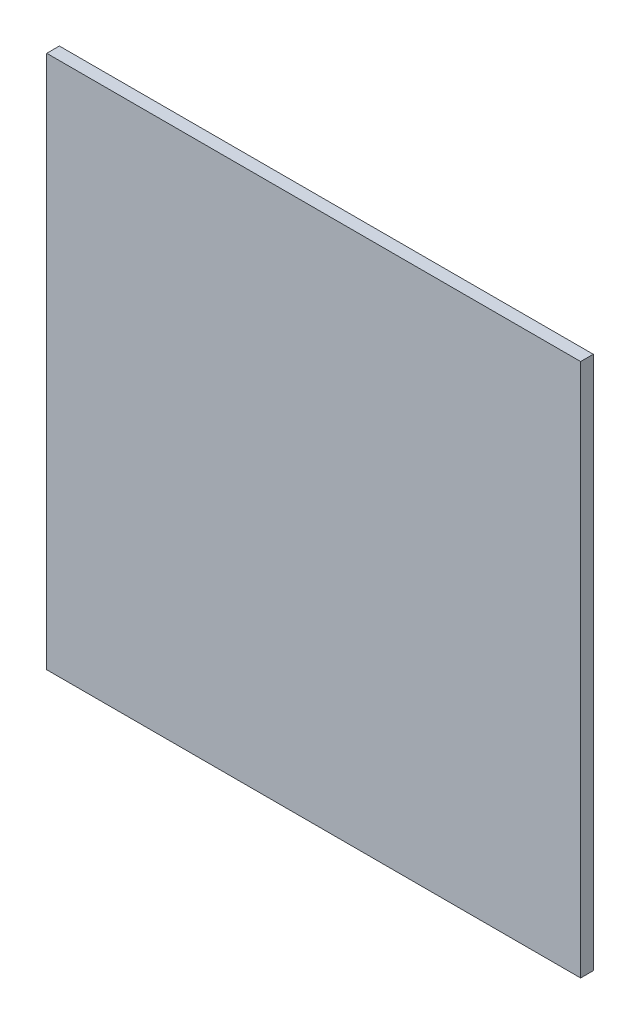
ISO-10303-21;
HEADER;
FILE_DESCRIPTION(('STEP AP214'),'2;1');
FILE_NAME('part.step','',(''),(''),'','','');
FILE_SCHEMA(('AUTOMOTIVE_DESIGN { 1 0 10303 214 1 1 1 1 }'));
ENDSEC;
DATA;
#1=APPLICATION_CONTEXT('core data for automotive mechanical design processes');
#2=APPLICATION_PROTOCOL_DEFINITION('international standard','automotive_design',2000,#1);
#3=PRODUCT_CONTEXT('',#1,'mechanical');
#4=PRODUCT('Part','Part','',(#3));
#5=PRODUCT_RELATED_PRODUCT_CATEGORY('part','',(#4));
#6=PRODUCT_DEFINITION_FORMATION('','',#4);
#7=PRODUCT_DEFINITION_CONTEXT('part definition',#1,'design');
#8=PRODUCT_DEFINITION('design','',#6,#7);
#9=PRODUCT_DEFINITION_SHAPE('','',#8);
#10=(LENGTH_UNIT() NAMED_UNIT(*) SI_UNIT(.MILLI.,.METRE.));
#11=(NAMED_UNIT(*) PLANE_ANGLE_UNIT() SI_UNIT($,.RADIAN.));
#12=(NAMED_UNIT(*) SI_UNIT($,.STERADIAN.) SOLID_ANGLE_UNIT());
#13=UNCERTAINTY_MEASURE_WITH_UNIT(LENGTH_MEASURE(1.E-05),#10,'distance_accuracy_value','');
#14=(GEOMETRIC_REPRESENTATION_CONTEXT(3) GLOBAL_UNCERTAINTY_ASSIGNED_CONTEXT((#13)) GLOBAL_UNIT_ASSIGNED_CONTEXT((#10,
#11,#12)) REPRESENTATION_CONTEXT('',''));
#15=CARTESIAN_POINT('',(0.,0.,0.));
#16=DIRECTION('',(0.,0.,1.));
#17=DIRECTION('',(1.,0.,0.));
#18=AXIS2_PLACEMENT_3D('',#15,#16,#17);
#19=CARTESIAN_POINT('',(8.57508,5.6,0.));
#20=DIRECTION('',(0.,0.,-1.));
#21=DIRECTION('',(-1.,0.,0.));
#22=AXIS2_PLACEMENT_3D('',#19,#20,#21);
#23=PLANE('',#22);
#24=DIRECTION('',(1.,0.,0.));
#25=VECTOR('',#24,1.);
#26=CARTESIAN_POINT('',(7.85008,6.325,0.));
#27=LINE('',#26,#25);
#28=CARTESIAN_POINT('',(7.85008,6.325,0.));
#29=VERTEX_POINT('',#28);
#30=CARTESIAN_POINT('',(9.30008,6.325,0.));
#31=VERTEX_POINT('',#30);
#32=EDGE_CURVE('E55',#29,#31,#27,.T.);
#33=ORIENTED_EDGE('',*,*,#32,.T.);
#34=DIRECTION('',(0.,1.,0.));
#35=VECTOR('',#34,1.);
#36=CARTESIAN_POINT('',(9.30008,6.325,0.));
#37=LINE('',#36,#35);
#38=CARTESIAN_POINT('',(9.30008,4.875,0.));
#39=VERTEX_POINT('',#38);
#40=EDGE_CURVE('E57',#31,#39,#37,.F.);
#41=ORIENTED_EDGE('',*,*,#40,.T.);
#42=DIRECTION('',(1.,0.,0.));
#43=VECTOR('',#42,1.);
#44=CARTESIAN_POINT('',(9.30008,4.875,0.));
#45=LINE('',#44,#43);
#46=CARTESIAN_POINT('',(7.85008,4.875,0.));
#47=VERTEX_POINT('',#46);
#48=EDGE_CURVE('E20',#39,#47,#45,.F.);
#49=ORIENTED_EDGE('',*,*,#48,.T.);
#50=DIRECTION('',(0.,1.,0.));
#51=VECTOR('',#50,1.);
#52=CARTESIAN_POINT('',(7.85008,4.875,0.));
#53=LINE('',#52,#51);
#54=EDGE_CURVE('E80',#47,#29,#53,.T.);
#55=ORIENTED_EDGE('',*,*,#54,.T.);
#56=EDGE_LOOP('',(#33,#41,#49,#55));
#57=FACE_BOUND('',#56,.T.);
#58=ADVANCED_FACE('F17',(#57),#23,.T.);
#59=CARTESIAN_POINT('',(9.30008,4.875,0.));
#60=DIRECTION('',(0.,1.,0.));
#61=DIRECTION('',(0.,0.,1.));
#62=AXIS2_PLACEMENT_3D('',#59,#60,#61);
#63=PLANE('',#62);
#64=DIRECTION('',(0.,0.,-1.));
#65=VECTOR('',#64,1.);
#66=CARTESIAN_POINT('',(7.85008,4.875,0.));
#67=LINE('',#66,#65);
#68=CARTESIAN_POINT('',(7.85008,4.875,0.03429));
#69=VERTEX_POINT('',#68);
#70=EDGE_CURVE('E68',#69,#47,#67,.T.);
#71=ORIENTED_EDGE('',*,*,#70,.T.);
#72=ORIENTED_EDGE('',*,*,#48,.F.);
#73=DIRECTION('',(0.,0.,1.));
#74=VECTOR('',#73,1.);
#75=CARTESIAN_POINT('',(9.30008,4.875,0.));
#76=LINE('',#75,#74);
#77=CARTESIAN_POINT('',(9.30008,4.875,0.03429));
#78=VERTEX_POINT('',#77);
#79=EDGE_CURVE('E63',#39,#78,#76,.T.);
#80=ORIENTED_EDGE('',*,*,#79,.T.);
#81=DIRECTION('',(1.,0.,0.));
#82=VECTOR('',#81,1.);
#83=CARTESIAN_POINT('',(8.57508,4.875,0.03429));
#84=LINE('',#83,#82);
#85=EDGE_CURVE('E83',#69,#78,#84,.T.);
#86=ORIENTED_EDGE('',*,*,#85,.F.);
#87=EDGE_LOOP('',(#71,#72,#80,#86));
#88=FACE_BOUND('',#87,.T.);
#89=ADVANCED_FACE('F65',(#88),#63,.F.);
#90=CARTESIAN_POINT('',(9.30008,6.325,0.));
#91=DIRECTION('',(-1.,0.,0.));
#92=DIRECTION('',(0.,0.,1.));
#93=AXIS2_PLACEMENT_3D('',#90,#91,#92);
#94=PLANE('',#93);
#95=ORIENTED_EDGE('',*,*,#79,.F.);
#96=ORIENTED_EDGE('',*,*,#40,.F.);
#97=DIRECTION('',(0.,0.,-1.));
#98=VECTOR('',#97,1.);
#99=CARTESIAN_POINT('',(9.30008,6.325,0.));
#100=LINE('',#99,#98);
#101=CARTESIAN_POINT('',(9.30008,6.325,0.03429));
#102=VERTEX_POINT('',#101);
#103=EDGE_CURVE('E75',#31,#102,#100,.F.);
#104=ORIENTED_EDGE('',*,*,#103,.T.);
#105=DIRECTION('',(0.,1.,0.));
#106=VECTOR('',#105,1.);
#107=CARTESIAN_POINT('',(9.30008,5.6,0.03429));
#108=LINE('',#107,#106);
#109=EDGE_CURVE('E72',#78,#102,#108,.T.);
#110=ORIENTED_EDGE('',*,*,#109,.F.);
#111=EDGE_LOOP('',(#95,#96,#104,#110));
#112=FACE_BOUND('',#111,.T.);
#113=ADVANCED_FACE('F70',(#112),#94,.F.);
#114=CARTESIAN_POINT('',(7.85008,6.325,0.));
#115=DIRECTION('',(0.,-1.,0.));
#116=DIRECTION('',(0.,0.,-1.));
#117=AXIS2_PLACEMENT_3D('',#114,#115,#116);
#118=PLANE('',#117);
#119=ORIENTED_EDGE('',*,*,#103,.F.);
#120=ORIENTED_EDGE('',*,*,#32,.F.);
#121=DIRECTION('',(0.,0.,-1.));
#122=VECTOR('',#121,1.);
#123=CARTESIAN_POINT('',(7.85008,6.325,0.));
#124=LINE('',#123,#122);
#125=CARTESIAN_POINT('',(7.85008,6.325,0.03429));
#126=VERTEX_POINT('',#125);
#127=EDGE_CURVE('E35',#29,#126,#124,.F.);
#128=ORIENTED_EDGE('',*,*,#127,.T.);
#129=DIRECTION('',(1.,0.,0.));
#130=VECTOR('',#129,1.);
#131=CARTESIAN_POINT('',(8.57508,6.325,0.03429));
#132=LINE('',#131,#130);
#133=EDGE_CURVE('E26',#102,#126,#132,.F.);
#134=ORIENTED_EDGE('',*,*,#133,.F.);
#135=EDGE_LOOP('',(#119,#120,#128,#134));
#136=FACE_BOUND('',#135,.T.);
#137=ADVANCED_FACE('F89',(#136),#118,.F.);
#138=CARTESIAN_POINT('',(7.85008,4.875,0.));
#139=DIRECTION('',(1.,0.,0.));
#140=DIRECTION('',(0.,0.,-1.));
#141=AXIS2_PLACEMENT_3D('',#138,#139,#140);
#142=PLANE('',#141);
#143=ORIENTED_EDGE('',*,*,#127,.F.);
#144=ORIENTED_EDGE('',*,*,#54,.F.);
#145=ORIENTED_EDGE('',*,*,#70,.F.);
#146=DIRECTION('',(0.,1.,0.));
#147=VECTOR('',#146,1.);
#148=CARTESIAN_POINT('',(7.85008,5.6,0.03429));
#149=LINE('',#148,#147);
#150=EDGE_CURVE('E11',#126,#69,#149,.F.);
#151=ORIENTED_EDGE('',*,*,#150,.F.);
#152=EDGE_LOOP('',(#143,#144,#145,#151));
#153=FACE_BOUND('',#152,.T.);
#154=ADVANCED_FACE('F91',(#153),#142,.F.);
#155=CARTESIAN_POINT('',(8.57508,5.6,0.03429));
#156=DIRECTION('',(0.,0.,1.));
#157=DIRECTION('',(1.,0.,0.));
#158=AXIS2_PLACEMENT_3D('',#155,#156,#157);
#159=PLANE('',#158);
#160=ORIENTED_EDGE('',*,*,#133,.T.);
#161=ORIENTED_EDGE('',*,*,#150,.T.);
#162=ORIENTED_EDGE('',*,*,#85,.T.);
#163=ORIENTED_EDGE('',*,*,#109,.T.);
#164=EDGE_LOOP('',(#160,#161,#162,#163));
#165=FACE_BOUND('',#164,.T.);
#166=ADVANCED_FACE('F88',(#165),#159,.T.);
#167=CLOSED_SHELL('',(#58,#89,#113,#137,#154,#166));
#168=MANIFOLD_SOLID_BREP('B1',#167);
#169=ADVANCED_BREP_SHAPE_REPRESENTATION('',(#18,#168),#14);
#170=SHAPE_DEFINITION_REPRESENTATION(#9,#169);
ENDSEC;
END-ISO-10303-21;
